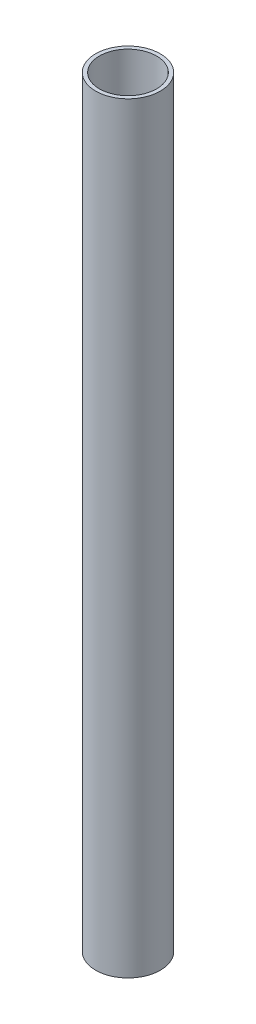
ISO-10303-21;
HEADER;
FILE_DESCRIPTION(('STEP AP214'),'2;1');
FILE_NAME('part.step','',(''),(''),'','','');
FILE_SCHEMA(('AUTOMOTIVE_DESIGN { 1 0 10303 214 1 1 1 1 }'));
ENDSEC;
DATA;
#1=APPLICATION_CONTEXT('core data for automotive mechanical design processes');
#2=APPLICATION_PROTOCOL_DEFINITION('international standard','automotive_design',2000,#1);
#3=PRODUCT_CONTEXT('',#1,'mechanical');
#4=PRODUCT('Part','Part','',(#3));
#5=PRODUCT_RELATED_PRODUCT_CATEGORY('part','',(#4));
#6=PRODUCT_DEFINITION_FORMATION('','',#4);
#7=PRODUCT_DEFINITION_CONTEXT('part definition',#1,'design');
#8=PRODUCT_DEFINITION('design','',#6,#7);
#9=PRODUCT_DEFINITION_SHAPE('','',#8);
#10=(LENGTH_UNIT() NAMED_UNIT(*) SI_UNIT(.MILLI.,.METRE.));
#11=(NAMED_UNIT(*) PLANE_ANGLE_UNIT() SI_UNIT($,.RADIAN.));
#12=(NAMED_UNIT(*) SI_UNIT($,.STERADIAN.) SOLID_ANGLE_UNIT());
#13=UNCERTAINTY_MEASURE_WITH_UNIT(LENGTH_MEASURE(1.E-05),#10,'distance_accuracy_value','');
#14=(GEOMETRIC_REPRESENTATION_CONTEXT(3) GLOBAL_UNCERTAINTY_ASSIGNED_CONTEXT((#13)) GLOBAL_UNIT_ASSIGNED_CONTEXT((#10,
#11,#12)) REPRESENTATION_CONTEXT('',''));
#15=CARTESIAN_POINT('',(0.,0.,0.));
#16=DIRECTION('',(0.,0.,1.));
#17=DIRECTION('',(1.,0.,0.));
#18=AXIS2_PLACEMENT_3D('',#15,#16,#17);
#19=CARTESIAN_POINT('',(0.,600.,0.));
#20=DIRECTION('',(0.,1.,0.));
#21=DIRECTION('',(0.,0.,1.));
#22=AXIS2_PLACEMENT_3D('',#19,#20,#21);
#23=PLANE('',#22);
#24=CARTESIAN_POINT('',(0.,600.,0.));
#25=DIRECTION('',(0.,1.,0.));
#26=DIRECTION('',(0.,0.,1.));
#27=AXIS2_PLACEMENT_3D('',#24,#25,#26);
#28=CIRCLE('',#27,25.5);
#29=CARTESIAN_POINT('',(0.,600.,25.5));
#30=VERTEX_POINT('',#29);
#31=EDGE_CURVE('E11',#30,#30,#28,.T.);
#32=ORIENTED_EDGE('',*,*,#31,.T.);
#33=EDGE_LOOP('',(#32));
#34=FACE_BOUND('',#33,.T.);
#35=CARTESIAN_POINT('',(0.,600.,0.));
#36=DIRECTION('',(0.,1.,0.));
#37=DIRECTION('',(1.,0.,0.));
#38=AXIS2_PLACEMENT_3D('',#35,#36,#37);
#39=CIRCLE('',#38,22.5);
#40=CARTESIAN_POINT('',(22.5,600.,0.));
#41=VERTEX_POINT('',#40);
#42=EDGE_CURVE('E49',#41,#41,#39,.T.);
#43=ORIENTED_EDGE('',*,*,#42,.F.);
#44=EDGE_LOOP('',(#43));
#45=FACE_BOUND('',#44,.T.);
#46=ADVANCED_FACE('F38',(#34,#45),#23,.T.);
#47=CARTESIAN_POINT('',(0.,0.,0.));
#48=DIRECTION('',(0.,1.,0.));
#49=DIRECTION('',(0.,0.,1.));
#50=AXIS2_PLACEMENT_3D('',#47,#48,#49);
#51=PLANE('',#50);
#52=CARTESIAN_POINT('',(0.,0.,0.));
#53=DIRECTION('',(0.,1.,0.));
#54=DIRECTION('',(0.,0.,1.));
#55=AXIS2_PLACEMENT_3D('',#52,#53,#54);
#56=CIRCLE('',#55,25.5);
#57=CARTESIAN_POINT('',(0.,0.,25.5));
#58=VERTEX_POINT('',#57);
#59=EDGE_CURVE('E42',#58,#58,#56,.T.);
#60=ORIENTED_EDGE('',*,*,#59,.F.);
#61=EDGE_LOOP('',(#60));
#62=FACE_BOUND('',#61,.T.);
#63=CARTESIAN_POINT('',(0.,0.,0.));
#64=DIRECTION('',(0.,1.,0.));
#65=DIRECTION('',(1.,0.,0.));
#66=AXIS2_PLACEMENT_3D('',#63,#64,#65);
#67=CIRCLE('',#66,22.5);
#68=CARTESIAN_POINT('',(22.5,0.,0.));
#69=VERTEX_POINT('',#68);
#70=EDGE_CURVE('E51',#69,#69,#67,.T.);
#71=ORIENTED_EDGE('',*,*,#70,.T.);
#72=EDGE_LOOP('',(#71));
#73=FACE_BOUND('',#72,.T.);
#74=ADVANCED_FACE('F61',(#62,#73),#51,.F.);
#75=CARTESIAN_POINT('',(0.,600.,0.));
#76=DIRECTION('',(0.,-1.,0.));
#77=DIRECTION('',(0.,0.,-1.));
#78=AXIS2_PLACEMENT_3D('',#75,#76,#77);
#79=CYLINDRICAL_SURFACE('',#78,25.5);
#80=ORIENTED_EDGE('',*,*,#31,.F.);
#81=EDGE_LOOP('',(#80));
#82=FACE_BOUND('',#81,.T.);
#83=ORIENTED_EDGE('',*,*,#59,.T.);
#84=EDGE_LOOP('',(#83));
#85=FACE_BOUND('',#84,.T.);
#86=ADVANCED_FACE('F40',(#82,#85),#79,.T.);
#87=CARTESIAN_POINT('',(0.,600.,0.));
#88=DIRECTION('',(0.,-1.,0.));
#89=DIRECTION('',(0.,0.,-1.));
#90=AXIS2_PLACEMENT_3D('',#87,#88,#89);
#91=CYLINDRICAL_SURFACE('',#90,22.5);
#92=ORIENTED_EDGE('',*,*,#42,.T.);
#93=EDGE_LOOP('',(#92));
#94=FACE_BOUND('',#93,.T.);
#95=ORIENTED_EDGE('',*,*,#70,.F.);
#96=EDGE_LOOP('',(#95));
#97=FACE_BOUND('',#96,.T.);
#98=ADVANCED_FACE('F57',(#94,#97),#91,.F.);
#99=CLOSED_SHELL('',(#46,#74,#86,#98));
#100=MANIFOLD_SOLID_BREP('B2',#99);
#101=ADVANCED_BREP_SHAPE_REPRESENTATION('',(#18,#100),#14);
#102=SHAPE_DEFINITION_REPRESENTATION(#9,#101);
ENDSEC;
END-ISO-10303-21;
